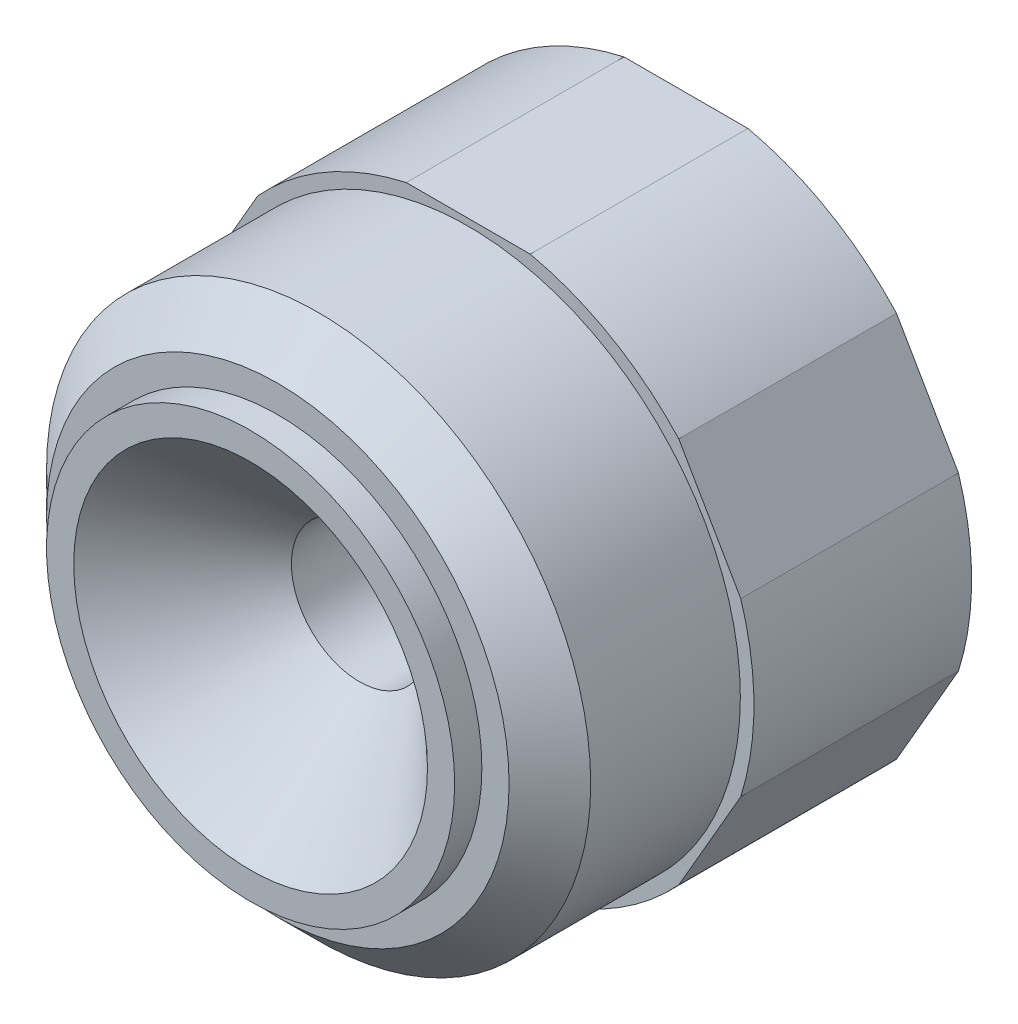
ISO-10303-21;
HEADER;
FILE_DESCRIPTION(('STEP AP214'),'2;1');
FILE_NAME('part.step','',(''),(''),'','','');
FILE_SCHEMA(('AUTOMOTIVE_DESIGN { 1 0 10303 214 1 1 1 1 }'));
ENDSEC;
DATA;
#1=APPLICATION_CONTEXT('core data for automotive mechanical design processes');
#2=APPLICATION_PROTOCOL_DEFINITION('international standard','automotive_design',2000,#1);
#3=PRODUCT_CONTEXT('',#1,'mechanical');
#4=PRODUCT('Part','Part','',(#3));
#5=PRODUCT_RELATED_PRODUCT_CATEGORY('part','',(#4));
#6=PRODUCT_DEFINITION_FORMATION('','',#4);
#7=PRODUCT_DEFINITION_CONTEXT('part definition',#1,'design');
#8=PRODUCT_DEFINITION('design','',#6,#7);
#9=PRODUCT_DEFINITION_SHAPE('','',#8);
#10=(LENGTH_UNIT() NAMED_UNIT(*) SI_UNIT(.MILLI.,.METRE.));
#11=(NAMED_UNIT(*) PLANE_ANGLE_UNIT() SI_UNIT($,.RADIAN.));
#12=(NAMED_UNIT(*) SI_UNIT($,.STERADIAN.) SOLID_ANGLE_UNIT());
#13=UNCERTAINTY_MEASURE_WITH_UNIT(LENGTH_MEASURE(1.E-05),#10,'distance_accuracy_value','');
#14=(GEOMETRIC_REPRESENTATION_CONTEXT(3) GLOBAL_UNCERTAINTY_ASSIGNED_CONTEXT((#13)) GLOBAL_UNIT_ASSIGNED_CONTEXT((#10,
#11,#12)) REPRESENTATION_CONTEXT('',''));
#15=CARTESIAN_POINT('',(0.,0.,0.));
#16=DIRECTION('',(0.,0.,1.));
#17=DIRECTION('',(1.,0.,0.));
#18=AXIS2_PLACEMENT_3D('',#15,#16,#17);
#19=CARTESIAN_POINT('',(0.,0.,-1072.));
#20=DIRECTION('',(0.,0.,1.));
#21=DIRECTION('',(1.,0.,0.));
#22=AXIS2_PLACEMENT_3D('',#19,#20,#21);
#23=PLANE('',#22);
#24=CARTESIAN_POINT('',(0.,0.,-1072.));
#25=DIRECTION('',(0.,0.,1.));
#26=DIRECTION('',(1.,0.,0.));
#27=AXIS2_PLACEMENT_3D('',#24,#25,#26);
#28=CIRCLE('',#27,15.375);
#29=CARTESIAN_POINT('',(15.375,0.,-1072.));
#30=VERTEX_POINT('',#29);
#31=EDGE_CURVE('E185',#30,#30,#28,.T.);
#32=ORIENTED_EDGE('',*,*,#31,.T.);
#33=EDGE_LOOP('',(#32));
#34=FACE_BOUND('',#33,.T.);
#35=CARTESIAN_POINT('',(0.,0.,-1072.));
#36=DIRECTION('',(0.,0.,-1.));
#37=DIRECTION('',(-1.,0.,0.));
#38=AXIS2_PLACEMENT_3D('',#35,#36,#37);
#39=CIRCLE('',#38,21.);
#40=CARTESIAN_POINT('',(4.55521678957215,20.5,-1072.));
#41=VERTEX_POINT('',#40);
#42=CARTESIAN_POINT('',(15.475912382795,14.1949334595148,-1072.));
#43=VERTEX_POINT('',#42);
#44=EDGE_CURVE('E262',#41,#43,#39,.T.);
#45=ORIENTED_EDGE('',*,*,#44,.T.);
#46=DIRECTION('',(0.5,-0.866025403784439,0.));
#47=VECTOR('',#46,1.);
#48=CARTESIAN_POINT('',(17.753520777581,10.25,-1072.));
#49=LINE('',#48,#47);
#50=CARTESIAN_POINT('',(20.031129172367,6.30506654048513,-1072.));
#51=VERTEX_POINT('',#50);
#52=EDGE_CURVE('E157',#43,#51,#49,.T.);
#53=ORIENTED_EDGE('',*,*,#52,.T.);
#54=CARTESIAN_POINT('',(20.0311291723671,-6.30506654048513,-1072.));
#55=VERTEX_POINT('',#54);
#56=EDGE_CURVE('E63',#51,#55,#39,.T.);
#57=ORIENTED_EDGE('',*,*,#56,.T.);
#58=DIRECTION('',(-0.5,-0.866025403784439,0.));
#59=VECTOR('',#58,1.);
#60=CARTESIAN_POINT('',(17.753520777581,-10.25,-1072.));
#61=LINE('',#60,#59);
#62=CARTESIAN_POINT('',(15.4759123827949,-14.1949334595148,-1072.));
#63=VERTEX_POINT('',#62);
#64=EDGE_CURVE('E165',#55,#63,#61,.T.);
#65=ORIENTED_EDGE('',*,*,#64,.T.);
#66=CARTESIAN_POINT('',(4.55521678957212,-20.5,-1072.));
#67=VERTEX_POINT('',#66);
#68=EDGE_CURVE('E55',#63,#67,#39,.T.);
#69=ORIENTED_EDGE('',*,*,#68,.T.);
#70=DIRECTION('',(-1.,0.,0.));
#71=VECTOR('',#70,1.);
#72=CARTESIAN_POINT('',(0.,-20.5,-1072.));
#73=LINE('',#72,#71);
#74=CARTESIAN_POINT('',(-4.55521678957211,-20.5,-1072.));
#75=VERTEX_POINT('',#74);
#76=EDGE_CURVE('E159',#67,#75,#73,.T.);
#77=ORIENTED_EDGE('',*,*,#76,.T.);
#78=CARTESIAN_POINT('',(-15.4759123827949,-14.1949334595148,-1072.));
#79=VERTEX_POINT('',#78);
#80=EDGE_CURVE('E149',#75,#79,#39,.T.);
#81=ORIENTED_EDGE('',*,*,#80,.T.);
#82=DIRECTION('',(-0.5,0.866025403784439,0.));
#83=VECTOR('',#82,1.);
#84=CARTESIAN_POINT('',(-17.753520777581,-10.25,-1072.));
#85=LINE('',#84,#83);
#86=CARTESIAN_POINT('',(-20.0311291723671,-6.30506654048513,-1072.));
#87=VERTEX_POINT('',#86);
#88=EDGE_CURVE('E148',#79,#87,#85,.T.);
#89=ORIENTED_EDGE('',*,*,#88,.T.);
#90=CARTESIAN_POINT('',(-20.0311291723671,6.30506654048513,-1072.));
#91=VERTEX_POINT('',#90);
#92=EDGE_CURVE('E131',#87,#91,#39,.T.);
#93=ORIENTED_EDGE('',*,*,#92,.T.);
#94=DIRECTION('',(0.5,0.866025403784439,0.));
#95=VECTOR('',#94,1.);
#96=CARTESIAN_POINT('',(-17.753520777581,10.25,-1072.));
#97=LINE('',#96,#95);
#98=CARTESIAN_POINT('',(-15.4759123827949,14.1949334595148,-1072.));
#99=VERTEX_POINT('',#98);
#100=EDGE_CURVE('E145',#91,#99,#97,.T.);
#101=ORIENTED_EDGE('',*,*,#100,.T.);
#102=CARTESIAN_POINT('',(-4.55521678957215,20.5,-1072.));
#103=VERTEX_POINT('',#102);
#104=EDGE_CURVE('E151',#99,#103,#39,.T.);
#105=ORIENTED_EDGE('',*,*,#104,.T.);
#106=DIRECTION('',(1.,0.,0.));
#107=VECTOR('',#106,1.);
#108=CARTESIAN_POINT('',(0.,20.5,-1072.));
#109=LINE('',#108,#107);
#110=EDGE_CURVE('E154',#103,#41,#109,.T.);
#111=ORIENTED_EDGE('',*,*,#110,.T.);
#112=EDGE_LOOP('',(#45,#53,#57,#65,#69,#77,#81,#89,#93,#101,#105,#111));
#113=FACE_BOUND('',#112,.T.);
#114=ADVANCED_FACE('F40',(#34,#113),#23,.F.);
#115=CARTESIAN_POINT('',(0.,0.,-1056.));
#116=DIRECTION('',(0.,0.,-1.));
#117=DIRECTION('',(-1.,0.,0.));
#118=AXIS2_PLACEMENT_3D('',#115,#116,#117);
#119=PLANE('',#118);
#120=CARTESIAN_POINT('',(0.,0.,-1056.));
#121=DIRECTION('',(0.,0.,-1.));
#122=DIRECTION('',(-1.,0.,0.));
#123=AXIS2_PLACEMENT_3D('',#120,#121,#122);
#124=CIRCLE('',#123,20.);
#125=CARTESIAN_POINT('',(-20.,0.,-1056.));
#126=VERTEX_POINT('',#125);
#127=EDGE_CURVE('E199',#126,#126,#124,.T.);
#128=ORIENTED_EDGE('',*,*,#127,.T.);
#129=EDGE_LOOP('',(#128));
#130=FACE_BOUND('',#129,.T.);
#131=CARTESIAN_POINT('',(0.,0.,-1056.));
#132=DIRECTION('',(0.,0.,-1.));
#133=DIRECTION('',(-1.,0.,0.));
#134=AXIS2_PLACEMENT_3D('',#131,#132,#133);
#135=CIRCLE('',#134,21.);
#136=CARTESIAN_POINT('',(-15.4759123827949,14.1949334595148,-1056.));
#137=VERTEX_POINT('',#136);
#138=CARTESIAN_POINT('',(-4.55521678957215,20.5,-1056.));
#139=VERTEX_POINT('',#138);
#140=EDGE_CURVE('E258',#137,#139,#135,.T.);
#141=ORIENTED_EDGE('',*,*,#140,.F.);
#142=DIRECTION('',(0.5,0.866025403784439,0.));
#143=VECTOR('',#142,1.);
#144=CARTESIAN_POINT('',(-17.753520777581,10.25,-1056.));
#145=LINE('',#144,#143);
#146=CARTESIAN_POINT('',(-20.0311291723671,6.30506654048513,-1056.));
#147=VERTEX_POINT('',#146);
#148=EDGE_CURVE('E219',#147,#137,#145,.T.);
#149=ORIENTED_EDGE('',*,*,#148,.F.);
#150=CARTESIAN_POINT('',(-20.0311291723671,-6.30506654048513,-1056.));
#151=VERTEX_POINT('',#150);
#152=EDGE_CURVE('E133',#151,#147,#135,.T.);
#153=ORIENTED_EDGE('',*,*,#152,.F.);
#154=DIRECTION('',(-0.5,0.866025403784439,0.));
#155=VECTOR('',#154,1.);
#156=CARTESIAN_POINT('',(-17.753520777581,-10.25,-1056.));
#157=LINE('',#156,#155);
#158=CARTESIAN_POINT('',(-15.4759123827949,-14.1949334595148,-1056.));
#159=VERTEX_POINT('',#158);
#160=EDGE_CURVE('E210',#159,#151,#157,.T.);
#161=ORIENTED_EDGE('',*,*,#160,.F.);
#162=CARTESIAN_POINT('',(-4.55521678957211,-20.5,-1056.));
#163=VERTEX_POINT('',#162);
#164=EDGE_CURVE('E217',#163,#159,#135,.T.);
#165=ORIENTED_EDGE('',*,*,#164,.F.);
#166=DIRECTION('',(-1.,0.,0.));
#167=VECTOR('',#166,1.);
#168=CARTESIAN_POINT('',(0.,-20.5,-1056.));
#169=LINE('',#168,#167);
#170=CARTESIAN_POINT('',(4.55521678957212,-20.5,-1056.));
#171=VERTEX_POINT('',#170);
#172=EDGE_CURVE('E168',#171,#163,#169,.T.);
#173=ORIENTED_EDGE('',*,*,#172,.F.);
#174=CARTESIAN_POINT('',(15.4759123827949,-14.1949334595148,-1056.));
#175=VERTEX_POINT('',#174);
#176=EDGE_CURVE('E236',#175,#171,#135,.T.);
#177=ORIENTED_EDGE('',*,*,#176,.F.);
#178=DIRECTION('',(-0.5,-0.866025403784439,0.));
#179=VECTOR('',#178,1.);
#180=CARTESIAN_POINT('',(17.753520777581,-10.25,-1056.));
#181=LINE('',#180,#179);
#182=CARTESIAN_POINT('',(20.0311291723671,-6.30506654048513,-1056.));
#183=VERTEX_POINT('',#182);
#184=EDGE_CURVE('E173',#183,#175,#181,.T.);
#185=ORIENTED_EDGE('',*,*,#184,.F.);
#186=CARTESIAN_POINT('',(20.031129172367,6.30506654048524,-1056.));
#187=VERTEX_POINT('',#186);
#188=EDGE_CURVE('E240',#187,#183,#135,.T.);
#189=ORIENTED_EDGE('',*,*,#188,.F.);
#190=DIRECTION('',(0.5,-0.866025403784439,0.));
#191=VECTOR('',#190,1.);
#192=CARTESIAN_POINT('',(17.753520777581,10.25,-1056.));
#193=LINE('',#192,#191);
#194=CARTESIAN_POINT('',(15.475912382795,14.1949334595148,-1056.));
#195=VERTEX_POINT('',#194);
#196=EDGE_CURVE('E228',#195,#187,#193,.T.);
#197=ORIENTED_EDGE('',*,*,#196,.F.);
#198=CARTESIAN_POINT('',(4.55521678957215,20.5,-1056.));
#199=VERTEX_POINT('',#198);
#200=EDGE_CURVE('E251',#199,#195,#135,.T.);
#201=ORIENTED_EDGE('',*,*,#200,.F.);
#202=DIRECTION('',(1.,0.,0.));
#203=VECTOR('',#202,1.);
#204=CARTESIAN_POINT('',(0.,20.5,-1056.));
#205=LINE('',#204,#203);
#206=EDGE_CURVE('E221',#139,#199,#205,.T.);
#207=ORIENTED_EDGE('',*,*,#206,.F.);
#208=EDGE_LOOP('',(#141,#149,#153,#161,#165,#173,#177,#185,#189,#197,#201,#207));
#209=FACE_BOUND('',#208,.T.);
#210=ADVANCED_FACE('F215',(#130,#209),#119,.F.);
#211=CARTESIAN_POINT('',(0.,-20.5,-1056.));
#212=DIRECTION('',(0.,-1.,0.));
#213=DIRECTION('',(1.,0.,0.));
#214=AXIS2_PLACEMENT_3D('',#211,#212,#213);
#215=PLANE('',#214);
#216=ORIENTED_EDGE('',*,*,#172,.T.);
#217=DIRECTION('',(0.,0.,-1.));
#218=VECTOR('',#217,1.);
#219=CARTESIAN_POINT('',(-4.55521678957211,-20.5,-1040.));
#220=LINE('',#219,#218);
#221=EDGE_CURVE('E260',#163,#75,#220,.T.);
#222=ORIENTED_EDGE('',*,*,#221,.T.);
#223=ORIENTED_EDGE('',*,*,#76,.F.);
#224=DIRECTION('',(0.,0.,-1.));
#225=VECTOR('',#224,1.);
#226=CARTESIAN_POINT('',(4.55521678957212,-20.5,-1040.));
#227=LINE('',#226,#225);
#228=EDGE_CURVE('E233',#67,#171,#227,.F.);
#229=ORIENTED_EDGE('',*,*,#228,.T.);
#230=EDGE_LOOP('',(#216,#222,#223,#229));
#231=FACE_BOUND('',#230,.T.);
#232=ADVANCED_FACE('F277',(#231),#215,.T.);
#233=CARTESIAN_POINT('',(17.753520777581,-10.25,-1056.));
#234=DIRECTION('',(0.866025403784439,-0.5,0.));
#235=DIRECTION('',(0.5,0.866025403784439,0.));
#236=AXIS2_PLACEMENT_3D('',#233,#234,#235);
#237=PLANE('',#236);
#238=ORIENTED_EDGE('',*,*,#184,.T.);
#239=DIRECTION('',(0.,0.,-1.));
#240=VECTOR('',#239,1.);
#241=CARTESIAN_POINT('',(15.4759123827949,-14.1949334595148,-1040.));
#242=LINE('',#241,#240);
#243=EDGE_CURVE('E238',#175,#63,#242,.T.);
#244=ORIENTED_EDGE('',*,*,#243,.T.);
#245=ORIENTED_EDGE('',*,*,#64,.F.);
#246=DIRECTION('',(0.,0.,-1.));
#247=VECTOR('',#246,1.);
#248=CARTESIAN_POINT('',(20.0311291723671,-6.30506654048513,-1040.));
#249=LINE('',#248,#247);
#250=EDGE_CURVE('E243',#55,#183,#249,.F.);
#251=ORIENTED_EDGE('',*,*,#250,.T.);
#252=EDGE_LOOP('',(#238,#244,#245,#251));
#253=FACE_BOUND('',#252,.T.);
#254=ADVANCED_FACE('F272',(#253),#237,.T.);
#255=CARTESIAN_POINT('',(17.753520777581,10.25,-1056.));
#256=DIRECTION('',(0.866025403784439,0.5,0.));
#257=DIRECTION('',(-0.5,0.866025403784439,0.));
#258=AXIS2_PLACEMENT_3D('',#255,#256,#257);
#259=PLANE('',#258);
#260=ORIENTED_EDGE('',*,*,#196,.T.);
#261=DIRECTION('',(0.,0.,-1.));
#262=VECTOR('',#261,1.);
#263=CARTESIAN_POINT('',(20.031129172367,6.30506654048524,-1040.));
#264=LINE('',#263,#262);
#265=EDGE_CURVE('E246',#187,#51,#264,.T.);
#266=ORIENTED_EDGE('',*,*,#265,.T.);
#267=ORIENTED_EDGE('',*,*,#52,.F.);
#268=DIRECTION('',(0.,0.,-1.));
#269=VECTOR('',#268,1.);
#270=CARTESIAN_POINT('',(15.475912382795,14.1949334595148,-1040.));
#271=LINE('',#270,#269);
#272=EDGE_CURVE('E248',#43,#195,#271,.F.);
#273=ORIENTED_EDGE('',*,*,#272,.T.);
#274=EDGE_LOOP('',(#260,#266,#267,#273));
#275=FACE_BOUND('',#274,.T.);
#276=ADVANCED_FACE('F284',(#275),#259,.T.);
#277=CARTESIAN_POINT('',(0.,20.5,-1056.));
#278=DIRECTION('',(0.,1.,0.));
#279=DIRECTION('',(0.,0.,1.));
#280=AXIS2_PLACEMENT_3D('',#277,#278,#279);
#281=PLANE('',#280);
#282=ORIENTED_EDGE('',*,*,#206,.T.);
#283=DIRECTION('',(0.,0.,-1.));
#284=VECTOR('',#283,1.);
#285=CARTESIAN_POINT('',(4.55521678957215,20.5,-1040.));
#286=LINE('',#285,#284);
#287=EDGE_CURVE('E252',#199,#41,#286,.T.);
#288=ORIENTED_EDGE('',*,*,#287,.T.);
#289=ORIENTED_EDGE('',*,*,#110,.F.);
#290=DIRECTION('',(0.,0.,-1.));
#291=VECTOR('',#290,1.);
#292=CARTESIAN_POINT('',(-4.55521678957215,20.5,-1040.));
#293=LINE('',#292,#291);
#294=EDGE_CURVE('E255',#103,#139,#293,.F.);
#295=ORIENTED_EDGE('',*,*,#294,.T.);
#296=EDGE_LOOP('',(#282,#288,#289,#295));
#297=FACE_BOUND('',#296,.T.);
#298=ADVANCED_FACE('F378',(#297),#281,.T.);
#299=CARTESIAN_POINT('',(-17.753520777581,10.25,-1056.));
#300=DIRECTION('',(-0.866025403784439,0.5,0.));
#301=DIRECTION('',(-0.5,-0.866025403784439,0.));
#302=AXIS2_PLACEMENT_3D('',#299,#300,#301);
#303=PLANE('',#302);
#304=ORIENTED_EDGE('',*,*,#148,.T.);
#305=DIRECTION('',(0.,0.,-1.));
#306=VECTOR('',#305,1.);
#307=CARTESIAN_POINT('',(-15.4759123827949,14.1949334595148,-1040.));
#308=LINE('',#307,#306);
#309=EDGE_CURVE('E138',#137,#99,#308,.T.);
#310=ORIENTED_EDGE('',*,*,#309,.T.);
#311=ORIENTED_EDGE('',*,*,#100,.F.);
#312=DIRECTION('',(0.,0.,-1.));
#313=VECTOR('',#312,1.);
#314=CARTESIAN_POINT('',(-20.0311291723671,6.30506654048513,-1040.));
#315=LINE('',#314,#313);
#316=EDGE_CURVE('E128',#91,#147,#315,.F.);
#317=ORIENTED_EDGE('',*,*,#316,.T.);
#318=EDGE_LOOP('',(#304,#310,#311,#317));
#319=FACE_BOUND('',#318,.T.);
#320=ADVANCED_FACE('F153',(#319),#303,.T.);
#321=CARTESIAN_POINT('',(-17.753520777581,-10.25,-1056.));
#322=DIRECTION('',(-0.866025403784439,-0.5,0.));
#323=DIRECTION('',(0.5,-0.866025403784439,0.));
#324=AXIS2_PLACEMENT_3D('',#321,#322,#323);
#325=PLANE('',#324);
#326=ORIENTED_EDGE('',*,*,#160,.T.);
#327=DIRECTION('',(0.,0.,-1.));
#328=VECTOR('',#327,1.);
#329=CARTESIAN_POINT('',(-20.0311291723671,-6.30506654048513,-1040.));
#330=LINE('',#329,#328);
#331=EDGE_CURVE('E12',#151,#87,#330,.T.);
#332=ORIENTED_EDGE('',*,*,#331,.T.);
#333=ORIENTED_EDGE('',*,*,#88,.F.);
#334=DIRECTION('',(0.,0.,-1.));
#335=VECTOR('',#334,1.);
#336=CARTESIAN_POINT('',(-15.4759123827949,-14.1949334595148,-1040.));
#337=LINE('',#336,#335);
#338=EDGE_CURVE('E48',#79,#159,#337,.F.);
#339=ORIENTED_EDGE('',*,*,#338,.T.);
#340=EDGE_LOOP('',(#326,#332,#333,#339));
#341=FACE_BOUND('',#340,.T.);
#342=ADVANCED_FACE('F209',(#341),#325,.T.);
#343=CARTESIAN_POINT('',(0.,0.,0.));
#344=DIRECTION('',(0.,0.,1.));
#345=DIRECTION('',(1.,0.,0.));
#346=AXIS2_PLACEMENT_3D('',#343,#344,#345);
#347=CYLINDRICAL_SURFACE('',#346,20.);
#348=CARTESIAN_POINT('',(0.,0.,-1045.));
#349=DIRECTION('',(0.,0.,1.));
#350=DIRECTION('',(1.,0.,0.));
#351=AXIS2_PLACEMENT_3D('',#348,#349,#350);
#352=CIRCLE('',#351,20.);
#353=CARTESIAN_POINT('',(20.,0.,-1045.));
#354=VERTEX_POINT('',#353);
#355=EDGE_CURVE('E182',#354,#354,#352,.T.);
#356=ORIENTED_EDGE('',*,*,#355,.F.);
#357=EDGE_LOOP('',(#356));
#358=FACE_BOUND('',#357,.T.);
#359=ORIENTED_EDGE('',*,*,#127,.F.);
#360=EDGE_LOOP('',(#359));
#361=FACE_BOUND('',#360,.T.);
#362=ADVANCED_FACE('F297',(#358,#361),#347,.T.);
#363=CARTESIAN_POINT('',(0.,0.,-1040.));
#364=DIRECTION('',(0.,0.,1.));
#365=DIRECTION('',(1.,0.,0.));
#366=AXIS2_PLACEMENT_3D('',#363,#364,#365);
#367=CONICAL_SURFACE('',#366,13.,0.785398163397447);
#368=CARTESIAN_POINT('',(0.,0.,-1048.));
#369=DIRECTION('',(0.,0.,1.));
#370=DIRECTION('',(1.,0.,0.));
#371=AXIS2_PLACEMENT_3D('',#368,#369,#370);
#372=CIRCLE('',#371,5.);
#373=CARTESIAN_POINT('',(5.,0.,-1048.));
#374=VERTEX_POINT('',#373);
#375=EDGE_CURVE('E196',#374,#374,#372,.T.);
#376=ORIENTED_EDGE('',*,*,#375,.F.);
#377=EDGE_LOOP('',(#376));
#378=FACE_BOUND('',#377,.T.);
#379=CARTESIAN_POINT('',(0.,0.,-1040.));
#380=DIRECTION('',(0.,0.,1.));
#381=DIRECTION('',(1.,0.,0.));
#382=AXIS2_PLACEMENT_3D('',#379,#380,#381);
#383=CIRCLE('',#382,13.);
#384=CARTESIAN_POINT('',(13.,0.,-1040.));
#385=VERTEX_POINT('',#384);
#386=EDGE_CURVE('E169',#385,#385,#383,.T.);
#387=ORIENTED_EDGE('',*,*,#386,.T.);
#388=EDGE_LOOP('',(#387));
#389=FACE_BOUND('',#388,.T.);
#390=ADVANCED_FACE('F314',(#378,#389),#367,.F.);
#391=CARTESIAN_POINT('',(0.,0.,0.));
#392=DIRECTION('',(0.,0.,1.));
#393=DIRECTION('',(1.,0.,0.));
#394=AXIS2_PLACEMENT_3D('',#391,#392,#393);
#395=CYLINDRICAL_SURFACE('',#394,5.);
#396=CARTESIAN_POINT('',(0.,0.,-1056.));
#397=DIRECTION('',(0.,0.,1.));
#398=DIRECTION('',(1.,0.,0.));
#399=AXIS2_PLACEMENT_3D('',#396,#397,#398);
#400=CIRCLE('',#399,5.);
#401=CARTESIAN_POINT('',(5.,0.,-1056.));
#402=VERTEX_POINT('',#401);
#403=EDGE_CURVE('E192',#402,#402,#400,.T.);
#404=ORIENTED_EDGE('',*,*,#403,.F.);
#405=EDGE_LOOP('',(#404));
#406=FACE_BOUND('',#405,.T.);
#407=ORIENTED_EDGE('',*,*,#375,.T.);
#408=EDGE_LOOP('',(#407));
#409=FACE_BOUND('',#408,.T.);
#410=ADVANCED_FACE('F311',(#406,#409),#395,.F.);
#411=CARTESIAN_POINT('',(0.,0.,-1056.));
#412=DIRECTION('',(0.,0.,-1.));
#413=DIRECTION('',(-1.,0.,0.));
#414=AXIS2_PLACEMENT_3D('',#411,#412,#413);
#415=PLANE('',#414);
#416=ORIENTED_EDGE('',*,*,#403,.T.);
#417=EDGE_LOOP('',(#416));
#418=FACE_BOUND('',#417,.T.);
#419=CARTESIAN_POINT('',(0.,0.,-1056.));
#420=DIRECTION('',(0.,0.,1.));
#421=DIRECTION('',(1.,0.,0.));
#422=AXIS2_PLACEMENT_3D('',#419,#420,#421);
#423=CIRCLE('',#422,16.7);
#424=CARTESIAN_POINT('',(16.7,0.,-1056.));
#425=VERTEX_POINT('',#424);
#426=EDGE_CURVE('E189',#425,#425,#423,.T.);
#427=ORIENTED_EDGE('',*,*,#426,.F.);
#428=EDGE_LOOP('',(#427));
#429=FACE_BOUND('',#428,.T.);
#430=ADVANCED_FACE('F307',(#418,#429),#415,.T.);
#431=CARTESIAN_POINT('',(0.,0.,0.));
#432=DIRECTION('',(0.,0.,1.));
#433=DIRECTION('',(1.,0.,0.));
#434=AXIS2_PLACEMENT_3D('',#431,#432,#433);
#435=CYLINDRICAL_SURFACE('',#434,16.7);
#436=CARTESIAN_POINT('',(0.,0.,-1061.));
#437=DIRECTION('',(0.,0.,-1.));
#438=DIRECTION('',(-1.,0.,0.));
#439=AXIS2_PLACEMENT_3D('',#436,#437,#438);
#440=CIRCLE('',#439,16.7);
#441=CARTESIAN_POINT('',(-16.7,0.,-1061.));
#442=VERTEX_POINT('',#441);
#443=EDGE_CURVE('E193',#442,#442,#440,.F.);
#444=ORIENTED_EDGE('',*,*,#443,.F.);
#445=EDGE_LOOP('',(#444));
#446=FACE_BOUND('',#445,.T.);
#447=ORIENTED_EDGE('',*,*,#426,.T.);
#448=EDGE_LOOP('',(#447));
#449=FACE_BOUND('',#448,.T.);
#450=ADVANCED_FACE('F304',(#446,#449),#435,.F.);
#451=CARTESIAN_POINT('',(0.,0.,-1061.));
#452=DIRECTION('',(0.,0.,-1.));
#453=DIRECTION('',(-1.,0.,0.));
#454=AXIS2_PLACEMENT_3D('',#451,#452,#453);
#455=PLANE('',#454);
#456=CARTESIAN_POINT('',(0.,0.,-1061.));
#457=DIRECTION('',(0.,0.,-1.));
#458=DIRECTION('',(-1.,0.,0.));
#459=AXIS2_PLACEMENT_3D('',#456,#457,#458);
#460=CIRCLE('',#459,15.375);
#461=CARTESIAN_POINT('',(-15.375,0.,-1061.));
#462=VERTEX_POINT('',#461);
#463=EDGE_CURVE('E188',#462,#462,#460,.F.);
#464=ORIENTED_EDGE('',*,*,#463,.F.);
#465=EDGE_LOOP('',(#464));
#466=FACE_BOUND('',#465,.T.);
#467=ORIENTED_EDGE('',*,*,#443,.T.);
#468=EDGE_LOOP('',(#467));
#469=FACE_BOUND('',#468,.T.);
#470=ADVANCED_FACE('F42',(#466,#469),#455,.F.);
#471=CARTESIAN_POINT('',(0.,0.,0.));
#472=DIRECTION('',(0.,0.,1.));
#473=DIRECTION('',(1.,0.,0.));
#474=AXIS2_PLACEMENT_3D('',#471,#472,#473);
#475=CYLINDRICAL_SURFACE('',#474,15.375);
#476=ORIENTED_EDGE('',*,*,#31,.F.);
#477=EDGE_LOOP('',(#476));
#478=FACE_BOUND('',#477,.T.);
#479=ORIENTED_EDGE('',*,*,#463,.T.);
#480=EDGE_LOOP('',(#479));
#481=FACE_BOUND('',#480,.T.);
#482=ADVANCED_FACE('F299',(#478,#481),#475,.F.);
#483=CARTESIAN_POINT('',(0.,0.,-1042.));
#484=DIRECTION('',(0.,0.,-1.));
#485=DIRECTION('',(-1.,0.,0.));
#486=AXIS2_PLACEMENT_3D('',#483,#484,#485);
#487=CONICAL_SURFACE('',#486,17.,0.785398163397466);
#488=ORIENTED_EDGE('',*,*,#355,.T.);
#489=EDGE_LOOP('',(#488));
#490=FACE_BOUND('',#489,.T.);
#491=CARTESIAN_POINT('',(0.,0.,-1042.));
#492=DIRECTION('',(0.,0.,1.));
#493=DIRECTION('',(1.,0.,0.));
#494=AXIS2_PLACEMENT_3D('',#491,#492,#493);
#495=CIRCLE('',#494,17.);
#496=CARTESIAN_POINT('',(17.,0.,-1042.));
#497=VERTEX_POINT('',#496);
#498=EDGE_CURVE('E179',#497,#497,#495,.T.);
#499=ORIENTED_EDGE('',*,*,#498,.F.);
#500=EDGE_LOOP('',(#499));
#501=FACE_BOUND('',#500,.T.);
#502=ADVANCED_FACE('F302',(#490,#501),#487,.T.);
#503=CARTESIAN_POINT('',(0.,0.,-1042.));
#504=DIRECTION('',(0.,0.,1.));
#505=DIRECTION('',(1.,0.,0.));
#506=AXIS2_PLACEMENT_3D('',#503,#504,#505);
#507=PLANE('',#506);
#508=ORIENTED_EDGE('',*,*,#498,.T.);
#509=EDGE_LOOP('',(#508));
#510=FACE_BOUND('',#509,.T.);
#511=CARTESIAN_POINT('',(0.,0.,-1042.));
#512=DIRECTION('',(0.,0.,1.));
#513=DIRECTION('',(1.,0.,0.));
#514=AXIS2_PLACEMENT_3D('',#511,#512,#513);
#515=CIRCLE('',#514,15.);
#516=CARTESIAN_POINT('',(15.,0.,-1042.));
#517=VERTEX_POINT('',#516);
#518=EDGE_CURVE('E176',#517,#517,#515,.T.);
#519=ORIENTED_EDGE('',*,*,#518,.F.);
#520=EDGE_LOOP('',(#519));
#521=FACE_BOUND('',#520,.T.);
#522=ADVANCED_FACE('F333',(#510,#521),#507,.T.);
#523=CARTESIAN_POINT('',(0.,0.,0.));
#524=DIRECTION('',(0.,0.,1.));
#525=DIRECTION('',(1.,0.,0.));
#526=AXIS2_PLACEMENT_3D('',#523,#524,#525);
#527=CYLINDRICAL_SURFACE('',#526,15.);
#528=ORIENTED_EDGE('',*,*,#518,.T.);
#529=EDGE_LOOP('',(#528));
#530=FACE_BOUND('',#529,.T.);
#531=CARTESIAN_POINT('',(0.,0.,-1040.));
#532=DIRECTION('',(0.,0.,1.));
#533=DIRECTION('',(1.,0.,0.));
#534=AXIS2_PLACEMENT_3D('',#531,#532,#533);
#535=CIRCLE('',#534,15.);
#536=CARTESIAN_POINT('',(15.,0.,-1040.));
#537=VERTEX_POINT('',#536);
#538=EDGE_CURVE('E172',#537,#537,#535,.T.);
#539=ORIENTED_EDGE('',*,*,#538,.F.);
#540=EDGE_LOOP('',(#539));
#541=FACE_BOUND('',#540,.T.);
#542=ADVANCED_FACE('F329',(#530,#541),#527,.T.);
#543=CARTESIAN_POINT('',(0.,0.,-1040.));
#544=DIRECTION('',(0.,0.,-1.));
#545=DIRECTION('',(-1.,0.,0.));
#546=AXIS2_PLACEMENT_3D('',#543,#544,#545);
#547=PLANE('',#546);
#548=ORIENTED_EDGE('',*,*,#386,.F.);
#549=EDGE_LOOP('',(#548));
#550=FACE_BOUND('',#549,.T.);
#551=ORIENTED_EDGE('',*,*,#538,.T.);
#552=EDGE_LOOP('',(#551));
#553=FACE_BOUND('',#552,.T.);
#554=ADVANCED_FACE('F326',(#550,#553),#547,.F.);
#555=CARTESIAN_POINT('',(0.,0.,-1040.));
#556=DIRECTION('',(0.,0.,-1.));
#557=DIRECTION('',(-1.,0.,0.));
#558=AXIS2_PLACEMENT_3D('',#555,#556,#557);
#559=CYLINDRICAL_SURFACE('',#558,21.);
#560=ORIENTED_EDGE('',*,*,#164,.T.);
#561=ORIENTED_EDGE('',*,*,#338,.F.);
#562=ORIENTED_EDGE('',*,*,#80,.F.);
#563=ORIENTED_EDGE('',*,*,#221,.F.);
#564=EDGE_LOOP('',(#560,#561,#562,#563));
#565=FACE_BOUND('',#564,.T.);
#566=ADVANCED_FACE('F276',(#565),#559,.T.);
#567=ORIENTED_EDGE('',*,*,#92,.F.);
#568=ORIENTED_EDGE('',*,*,#331,.F.);
#569=ORIENTED_EDGE('',*,*,#152,.T.);
#570=ORIENTED_EDGE('',*,*,#316,.F.);
#571=EDGE_LOOP('',(#567,#568,#569,#570));
#572=FACE_BOUND('',#571,.T.);
#573=ADVANCED_FACE('F130',(#572),#559,.T.);
#574=ORIENTED_EDGE('',*,*,#104,.F.);
#575=ORIENTED_EDGE('',*,*,#309,.F.);
#576=ORIENTED_EDGE('',*,*,#140,.T.);
#577=ORIENTED_EDGE('',*,*,#294,.F.);
#578=EDGE_LOOP('',(#574,#575,#576,#577));
#579=FACE_BOUND('',#578,.T.);
#580=ADVANCED_FACE('F419',(#579),#559,.T.);
#581=ORIENTED_EDGE('',*,*,#44,.F.);
#582=ORIENTED_EDGE('',*,*,#287,.F.);
#583=ORIENTED_EDGE('',*,*,#200,.T.);
#584=ORIENTED_EDGE('',*,*,#272,.F.);
#585=EDGE_LOOP('',(#581,#582,#583,#584));
#586=FACE_BOUND('',#585,.T.);
#587=ADVANCED_FACE('F425',(#586),#559,.T.);
#588=ORIENTED_EDGE('',*,*,#56,.F.);
#589=ORIENTED_EDGE('',*,*,#265,.F.);
#590=ORIENTED_EDGE('',*,*,#188,.T.);
#591=ORIENTED_EDGE('',*,*,#250,.F.);
#592=EDGE_LOOP('',(#588,#589,#590,#591));
#593=FACE_BOUND('',#592,.T.);
#594=ADVANCED_FACE('F267',(#593),#559,.T.);
#595=ORIENTED_EDGE('',*,*,#68,.F.);
#596=ORIENTED_EDGE('',*,*,#243,.F.);
#597=ORIENTED_EDGE('',*,*,#176,.T.);
#598=ORIENTED_EDGE('',*,*,#228,.F.);
#599=EDGE_LOOP('',(#595,#596,#597,#598));
#600=FACE_BOUND('',#599,.T.);
#601=ADVANCED_FACE('F274',(#600),#559,.T.);
#602=CLOSED_SHELL('',(#114,#210,#232,#254,#276,#298,#320,#342,#362,#390,#410,#430,#450,#470,
#482,#502,#522,#542,#554,#566,#573,#580,#587,#594,#601));
#603=MANIFOLD_SOLID_BREP('B2',#602);
#604=ADVANCED_BREP_SHAPE_REPRESENTATION('',(#18,#603),#14);
#605=SHAPE_DEFINITION_REPRESENTATION(#9,#604);
ENDSEC;
END-ISO-10303-21;
